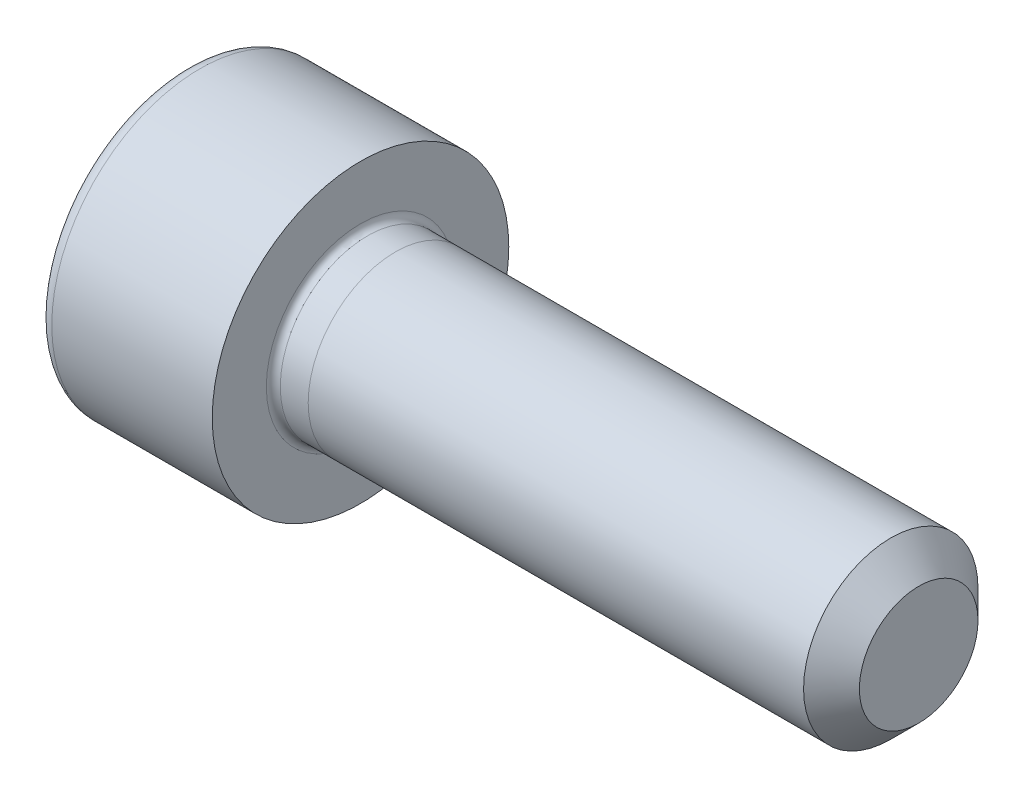
ISO-10303-21;
HEADER;
FILE_DESCRIPTION(('STEP AP214'),'2;1');
FILE_NAME('part.step','',(''),(''),'','','');
FILE_SCHEMA(('AUTOMOTIVE_DESIGN { 1 0 10303 214 1 1 1 1 }'));
ENDSEC;
DATA;
#1=APPLICATION_CONTEXT('core data for automotive mechanical design processes');
#2=APPLICATION_PROTOCOL_DEFINITION('international standard','automotive_design',2000,#1);
#3=PRODUCT_CONTEXT('',#1,'mechanical');
#4=PRODUCT('Part','Part','',(#3));
#5=PRODUCT_RELATED_PRODUCT_CATEGORY('part','',(#4));
#6=PRODUCT_DEFINITION_FORMATION('','',#4);
#7=PRODUCT_DEFINITION_CONTEXT('part definition',#1,'design');
#8=PRODUCT_DEFINITION('design','',#6,#7);
#9=PRODUCT_DEFINITION_SHAPE('','',#8);
#10=(LENGTH_UNIT() NAMED_UNIT(*) SI_UNIT(.MILLI.,.METRE.));
#11=(NAMED_UNIT(*) PLANE_ANGLE_UNIT() SI_UNIT($,.RADIAN.));
#12=(NAMED_UNIT(*) SI_UNIT($,.STERADIAN.) SOLID_ANGLE_UNIT());
#13=UNCERTAINTY_MEASURE_WITH_UNIT(LENGTH_MEASURE(1.E-05),#10,'distance_accuracy_value','');
#14=(GEOMETRIC_REPRESENTATION_CONTEXT(3) GLOBAL_UNCERTAINTY_ASSIGNED_CONTEXT((#13)) GLOBAL_UNIT_ASSIGNED_CONTEXT((#10,
#11,#12)) REPRESENTATION_CONTEXT('',''));
#15=CARTESIAN_POINT('',(0.,0.,0.));
#16=DIRECTION('',(0.,0.,1.));
#17=DIRECTION('',(1.,0.,0.));
#18=AXIS2_PLACEMENT_3D('',#15,#16,#17);
#19=CARTESIAN_POINT('',(16.,0.,0.));
#20=DIRECTION('',(-1.,0.,0.));
#21=DIRECTION('',(0.,0.,1.));
#22=AXIS2_PLACEMENT_3D('',#19,#20,#21);
#23=CYLINDRICAL_SURFACE('',#22,2.5);
#24=CARTESIAN_POINT('',(0.199999999999978,0.,0.));
#25=DIRECTION('',(-1.,0.,0.));
#26=DIRECTION('',(0.,0.,1.));
#27=AXIS2_PLACEMENT_3D('',#24,#25,#26);
#28=CIRCLE('',#27,2.5);
#29=CARTESIAN_POINT('',(0.199999999999978,0.,2.5));
#30=VERTEX_POINT('',#29);
#31=EDGE_CURVE('E195',#30,#30,#28,.F.);
#32=ORIENTED_EDGE('',*,*,#31,.T.);
#33=EDGE_LOOP('',(#32));
#34=FACE_BOUND('',#33,.T.);
#35=CARTESIAN_POINT('',(1.,0.,0.));
#36=DIRECTION('',(1.,0.,0.));
#37=DIRECTION('',(0.,1.,0.));
#38=AXIS2_PLACEMENT_3D('',#35,#36,#37);
#39=CIRCLE('',#38,2.5);
#40=CARTESIAN_POINT('',(1.,2.49999999999997,0.));
#41=VERTEX_POINT('',#40);
#42=EDGE_CURVE('E11',#41,#41,#39,.T.);
#43=ORIENTED_EDGE('',*,*,#42,.F.);
#44=EDGE_LOOP('',(#43));
#45=FACE_BOUND('',#44,.T.);
#46=ADVANCED_FACE('F44',(#34,#45),#23,.T.);
#47=ORIENTED_EDGE('',*,*,#42,.T.);
#48=EDGE_LOOP('',(#47));
#49=FACE_BOUND('',#48,.T.);
#50=CARTESIAN_POINT('',(15.2,0.,0.));
#51=DIRECTION('',(1.,0.,0.));
#52=DIRECTION('',(0.,0.,-1.));
#53=AXIS2_PLACEMENT_3D('',#50,#51,#52);
#54=CIRCLE('',#53,2.5);
#55=CARTESIAN_POINT('',(15.2,0.,-2.49999999999996));
#56=VERTEX_POINT('',#55);
#57=EDGE_CURVE('E179',#56,#56,#54,.F.);
#58=ORIENTED_EDGE('',*,*,#57,.T.);
#59=EDGE_LOOP('',(#58));
#60=FACE_BOUND('',#59,.T.);
#61=ADVANCED_FACE('F296',(#49,#60),#23,.T.);
#62=CARTESIAN_POINT('',(16.,0.,0.));
#63=DIRECTION('',(1.,0.,0.));
#64=DIRECTION('',(0.,0.,-1.));
#65=AXIS2_PLACEMENT_3D('',#62,#63,#64);
#66=PLANE('',#65);
#67=CARTESIAN_POINT('',(16.,0.,0.));
#68=DIRECTION('',(1.,0.,0.));
#69=DIRECTION('',(0.,0.,-1.));
#70=AXIS2_PLACEMENT_3D('',#67,#68,#69);
#71=CIRCLE('',#70,1.7);
#72=CARTESIAN_POINT('',(16.,0.,-1.7));
#73=VERTEX_POINT('',#72);
#74=EDGE_CURVE('E175',#73,#73,#71,.T.);
#75=ORIENTED_EDGE('',*,*,#74,.T.);
#76=EDGE_LOOP('',(#75));
#77=FACE_BOUND('',#76,.T.);
#78=ADVANCED_FACE('F302',(#77),#66,.T.);
#79=CARTESIAN_POINT('',(0.,0.,0.));
#80=DIRECTION('',(-1.,0.,0.));
#81=DIRECTION('',(0.,0.,1.));
#82=AXIS2_PLACEMENT_3D('',#79,#80,#81);
#83=PLANE('',#82);
#84=CARTESIAN_POINT('',(0.,0.,0.));
#85=DIRECTION('',(-1.,0.,0.));
#86=DIRECTION('',(0.,0.,1.));
#87=AXIS2_PLACEMENT_3D('',#84,#85,#86);
#88=CIRCLE('',#87,2.7);
#89=CARTESIAN_POINT('',(0.,0.,2.7));
#90=VERTEX_POINT('',#89);
#91=EDGE_CURVE('E191',#90,#90,#88,.T.);
#92=ORIENTED_EDGE('',*,*,#91,.T.);
#93=EDGE_LOOP('',(#92));
#94=FACE_BOUND('',#93,.T.);
#95=CARTESIAN_POINT('',(0.,0.,0.));
#96=DIRECTION('',(-1.,0.,0.));
#97=DIRECTION('',(0.,0.,1.));
#98=AXIS2_PLACEMENT_3D('',#95,#96,#97);
#99=CIRCLE('',#98,4.25);
#100=CARTESIAN_POINT('',(0.,0.,4.25));
#101=VERTEX_POINT('',#100);
#102=EDGE_CURVE('E171',#101,#101,#99,.T.);
#103=ORIENTED_EDGE('',*,*,#102,.F.);
#104=EDGE_LOOP('',(#103));
#105=FACE_BOUND('',#104,.T.);
#106=ADVANCED_FACE('F328',(#94,#105),#83,.F.);
#107=CARTESIAN_POINT('',(-5.,0.,0.));
#108=DIRECTION('',(1.,0.,0.));
#109=DIRECTION('',(0.,0.,-1.));
#110=AXIS2_PLACEMENT_3D('',#107,#108,#109);
#111=CYLINDRICAL_SURFACE('',#110,4.25);
#112=CARTESIAN_POINT('',(-4.59999999999999,0.,0.));
#113=DIRECTION('',(-1.,0.,0.));
#114=DIRECTION('',(0.,0.,1.));
#115=AXIS2_PLACEMENT_3D('',#112,#113,#114);
#116=CIRCLE('',#115,4.25);
#117=CARTESIAN_POINT('',(-4.59999999999999,0.,4.25000000000001));
#118=VERTEX_POINT('',#117);
#119=EDGE_CURVE('E187',#118,#118,#116,.F.);
#120=ORIENTED_EDGE('',*,*,#119,.T.);
#121=EDGE_LOOP('',(#120));
#122=FACE_BOUND('',#121,.T.);
#123=ORIENTED_EDGE('',*,*,#102,.T.);
#124=EDGE_LOOP('',(#123));
#125=FACE_BOUND('',#124,.T.);
#126=ADVANCED_FACE('F331',(#122,#125),#111,.T.);
#127=CARTESIAN_POINT('',(-5.,0.,0.));
#128=DIRECTION('',(-1.,0.,0.));
#129=DIRECTION('',(0.,0.,1.));
#130=AXIS2_PLACEMENT_3D('',#127,#128,#129);
#131=PLANE('',#130);
#132=CARTESIAN_POINT('',(-5.,0.,0.));
#133=DIRECTION('',(-1.,0.,0.));
#134=DIRECTION('',(0.,0.,1.));
#135=AXIS2_PLACEMENT_3D('',#132,#133,#134);
#136=CIRCLE('',#135,2.4);
#137=CARTESIAN_POINT('',(-5.,0.,2.40000000000001));
#138=VERTEX_POINT('',#137);
#139=EDGE_CURVE('E199',#138,#138,#136,.F.);
#140=ORIENTED_EDGE('',*,*,#139,.T.);
#141=EDGE_LOOP('',(#140));
#142=FACE_BOUND('',#141,.T.);
#143=CARTESIAN_POINT('',(-5.,0.,0.));
#144=DIRECTION('',(-1.,0.,0.));
#145=DIRECTION('',(0.,0.,1.));
#146=AXIS2_PLACEMENT_3D('',#143,#144,#145);
#147=CIRCLE('',#146,3.85);
#148=CARTESIAN_POINT('',(-5.00000000000001,0.,3.85000000000001));
#149=VERTEX_POINT('',#148);
#150=EDGE_CURVE('E183',#149,#149,#147,.T.);
#151=ORIENTED_EDGE('',*,*,#150,.T.);
#152=EDGE_LOOP('',(#151));
#153=FACE_BOUND('',#152,.T.);
#154=ADVANCED_FACE('F312',(#142,#153),#131,.T.);
#155=CARTESIAN_POINT('',(16.,0.,0.));
#156=DIRECTION('',(-1.,0.,0.));
#157=DIRECTION('',(0.,0.,1.));
#158=AXIS2_PLACEMENT_3D('',#155,#156,#157);
#159=CONICAL_SURFACE('',#158,1.7,0.785398163397446);
#160=ORIENTED_EDGE('',*,*,#57,.F.);
#161=EDGE_LOOP('',(#160));
#162=FACE_BOUND('',#161,.T.);
#163=ORIENTED_EDGE('',*,*,#74,.F.);
#164=EDGE_LOOP('',(#163));
#165=FACE_BOUND('',#164,.T.);
#166=ADVANCED_FACE('F308',(#162,#165),#159,.T.);
#167=CARTESIAN_POINT('',(-4.59999999999999,0.,0.));
#168=DIRECTION('',(-1.,0.,0.));
#169=DIRECTION('',(0.,0.,1.));
#170=AXIS2_PLACEMENT_3D('',#167,#168,#169);
#171=TOROIDAL_SURFACE('',#170,3.85,0.4);
#172=ORIENTED_EDGE('',*,*,#119,.F.);
#173=EDGE_LOOP('',(#172));
#174=FACE_BOUND('',#173,.T.);
#175=ORIENTED_EDGE('',*,*,#150,.F.);
#176=EDGE_LOOP('',(#175));
#177=FACE_BOUND('',#176,.T.);
#178=ADVANCED_FACE('F311',(#174,#177),#171,.T.);
#179=CARTESIAN_POINT('',(0.199999999999978,0.,0.));
#180=DIRECTION('',(-1.,0.,0.));
#181=DIRECTION('',(0.,0.,1.));
#182=AXIS2_PLACEMENT_3D('',#179,#180,#181);
#183=TOROIDAL_SURFACE('',#182,2.7,0.2);
#184=ORIENTED_EDGE('',*,*,#31,.F.);
#185=EDGE_LOOP('',(#184));
#186=FACE_BOUND('',#185,.T.);
#187=ORIENTED_EDGE('',*,*,#91,.F.);
#188=EDGE_LOOP('',(#187));
#189=FACE_BOUND('',#188,.T.);
#190=ADVANCED_FACE('F315',(#186,#189),#183,.F.);
#191=CARTESIAN_POINT('',(-4.76905989232412,0.,0.));
#192=DIRECTION('',(-1.,0.,0.));
#193=DIRECTION('',(0.,0.,1.));
#194=AXIS2_PLACEMENT_3D('',#191,#192,#193);
#195=CONICAL_SURFACE('',#194,2.,1.0471975511966);
#196=CARTESIAN_POINT('',(-4.94775935894465,0.000200000000005751,-2.3095165468123));
#197=CARTESIAN_POINT('',(-4.91844942842481,-0.087691262900059,-2.25877250251755));
#198=CARTESIAN_POINT('',(-4.8917927443046,-0.176341194473595,-2.20759044065994));
#199=CARTESIAN_POINT('',(-4.84526238334485,-0.355176246997811,-2.10433997494455));
#200=CARTESIAN_POINT('',(-4.82540516870691,-0.445364546505047,-2.05226973594629));
#201=CARTESIAN_POINT('',(-4.79449335634738,-0.624623385763312,-1.9487745968459));
#202=CARTESIAN_POINT('',(-4.78323304392266,-0.713666338226305,-1.89736562427194));
#203=CARTESIAN_POINT('',(-4.76978855491878,-0.892171397785061,-1.79430568008402));
#204=CARTESIAN_POINT('',(-4.76759324727761,-0.981632855703997,-1.74265508327248));
#205=CARTESIAN_POINT('',(-4.77215088165479,-1.14880835354883,-1.64613626458984));
#206=CARTESIAN_POINT('',(-4.77778476701115,-1.2265473702658,-1.60125362236172));
#207=CARTESIAN_POINT('',(-4.79564378758496,-1.38151891453613,-1.51178075956048));
#208=CARTESIAN_POINT('',(-4.80787502834758,-1.4587509057412,-1.4671908486482));
#209=CARTESIAN_POINT('',(-4.83845332919175,-1.6140421864822,-1.37753338590959));
#210=CARTESIAN_POINT('',(-4.85693005938985,-1.69208181310737,-1.33247718647008));
#211=CARTESIAN_POINT('',(-4.89886541053699,-1.84699686569212,-1.24303693915875));
#212=CARTESIAN_POINT('',(-4.92231417281645,-1.9238742776231,-1.19865174468579));
#213=CARTESIAN_POINT('',(-4.94775935894465,-2.00019999999998,-1.15458506832541));
#214=B_SPLINE_CURVE_WITH_KNOTS('',3,(#196,#197,#198,#199,#200,#201,#202,#203,#204,#205,#206,
#207,#208,#209,#210,#211,#212,#213),.UNSPECIFIED.,.F.,.F.,(4,2,2,2,2,2,2,2,4),(0.,
0.317031824695614,0.634825876346569,0.944753967652642,1.25430138000372,1.52387047293094,
1.79368946861027,2.06949491027632,2.3447585082147),.UNSPECIFIED.);
#215=CARTESIAN_POINT('',(-4.94769268727824,0.,-2.30940107675848));
#216=VERTEX_POINT('',#215);
#217=CARTESIAN_POINT('',(-4.94769268727824,-1.99999999999995,-1.15470053837927));
#218=VERTEX_POINT('',#217);
#219=EDGE_CURVE('E254',#216,#218,#214,.T.);
#220=ORIENTED_EDGE('',*,*,#219,.F.);
#221=CARTESIAN_POINT('',(-4.94775935894465,2.00020000000004,-1.15458506832539));
#222=CARTESIAN_POINT('',(-4.91844942842481,1.91230873709997,-1.20532911262015));
#223=CARTESIAN_POINT('',(-4.89179274430459,1.82365880552644,-1.25651117447777));
#224=CARTESIAN_POINT('',(-4.84526238334484,1.64482375300222,-1.35976164019317));
#225=CARTESIAN_POINT('',(-4.8254051687069,1.55463545349498,-1.41183187919143));
#226=CARTESIAN_POINT('',(-4.79449335634737,1.37537661423671,-1.51532701829182));
#227=CARTESIAN_POINT('',(-4.78323304392264,1.28633366177371,-1.56673599086577));
#228=CARTESIAN_POINT('',(-4.76978855491877,1.10782860221496,-1.66979593505372));
#229=CARTESIAN_POINT('',(-4.76759324727761,1.01836714429604,-1.7214465318653));
#230=CARTESIAN_POINT('',(-4.77215088165479,0.851191646451192,-1.81796535054793));
#231=CARTESIAN_POINT('',(-4.77778476701114,0.773452629734206,-1.86284799277603));
#232=CARTESIAN_POINT('',(-4.79564378758495,0.618481085463856,-1.95232085557725));
#233=CARTESIAN_POINT('',(-4.80787502834756,0.541249094258791,-1.99691076648954));
#234=CARTESIAN_POINT('',(-4.83845332919174,0.385957813517788,-2.08656822922816));
#235=CARTESIAN_POINT('',(-4.85693005938984,0.307918186892609,-2.13162442866766));
#236=CARTESIAN_POINT('',(-4.89886541053699,0.153003134307854,-2.221064675979));
#237=CARTESIAN_POINT('',(-4.92231417281645,0.0761257223768703,-2.26544987045196));
#238=CARTESIAN_POINT('',(-4.94775935894465,-0.000200000000005751,-2.30951654681234));
#239=B_SPLINE_CURVE_WITH_KNOTS('',3,(#221,#222,#223,#224,#225,#226,#227,#228,#229,#230,#231,
#232,#233,#234,#235,#236,#237,#238),.UNSPECIFIED.,.F.,.F.,(4,2,2,2,2,2,2,2,4),(0.,
0.317031824695627,0.634825876346591,0.944753967652676,1.25430138000377,1.523870472931,
1.79368946861034,2.0694949102764,2.34475850821479),.UNSPECIFIED.);
#240=CARTESIAN_POINT('',(-4.94769268727824,2.00000000000003,-1.15470053837924));
#241=VERTEX_POINT('',#240);
#242=EDGE_CURVE('E231',#241,#216,#239,.T.);
#243=ORIENTED_EDGE('',*,*,#242,.F.);
#244=CARTESIAN_POINT('',(-5.7296245130441,2.,-3.06969706647028));
#245=CARTESIAN_POINT('',(-5.68750761154934,2.00000000000002,-2.98260702760984));
#246=CARTESIAN_POINT('',(-5.64580390848698,2.00000000000003,-2.8953135951495));
#247=CARTESIAN_POINT('',(-5.56345596036491,2.00000000000003,-2.72021165343405));
#248=CARTESIAN_POINT('',(-5.52281188889613,2.00000000000003,-2.63240306263539));
#249=CARTESIAN_POINT('',(-5.44260488331756,2.00000000000003,-2.45569454632304));
#250=CARTESIAN_POINT('',(-5.40304932826782,2.00000000000003,-2.36679125959118));
#251=CARTESIAN_POINT('',(-5.32560029447873,2.00000000000003,-2.18826628410369));
#252=CARTESIAN_POINT('',(-5.28770673495887,2.00000000000003,-2.09864463051492));
#253=CARTESIAN_POINT('',(-5.21288954587424,2.00000000000003,-1.91577344840972));
#254=CARTESIAN_POINT('',(-5.1760313704263,2.00000000000003,-1.82249699059148));
#255=CARTESIAN_POINT('',(-5.10518283158684,2.00000000000003,-1.63484103533505));
#256=CARTESIAN_POINT('',(-5.07119279447057,2.00000000000003,-1.54046141378923));
#257=CARTESIAN_POINT('',(-5.00699637104713,2.00000000000003,-1.35063624877524));
#258=CARTESIAN_POINT('',(-4.97678203952794,2.00000000000002,-1.25519342016053));
#259=CARTESIAN_POINT('',(-4.92112753019565,2.00000000000004,-1.06293935737286));
#260=CARTESIAN_POINT('',(-4.89568581427327,2.00000000000006,-0.966128574914693));
#261=CARTESIAN_POINT('',(-4.85095209042622,2.00000000000006,-0.771614672106002));
#262=CARTESIAN_POINT('',(-4.83162795344868,2.00000000000004,-0.673919082405816));
#263=CARTESIAN_POINT('',(-4.80024257522784,2.00000000000002,-0.477348057700167));
#264=CARTESIAN_POINT('',(-4.78818070998057,2.00000000000003,-0.378472724807782));
#265=CARTESIAN_POINT('',(-4.77244384927367,2.00000000000003,-0.181309994953027));
#266=CARTESIAN_POINT('',(-4.76866358667925,2.00000000000004,-0.0830312460429689));
#267=CARTESIAN_POINT('',(-4.76952313075927,2.00000000000002,0.113485509919459));
#268=CARTESIAN_POINT('',(-4.77416316778038,2.00000000000001,0.211723515783724));
#269=CARTESIAN_POINT('',(-4.79516424597696,2.,0.449358015625662));
#270=CARTESIAN_POINT('',(-4.81568943998104,2.00000000000002,0.588388308666211));
#271=CARTESIAN_POINT('',(-4.86992569623103,2.00000000000004,0.863858384666757));
#272=CARTESIAN_POINT('',(-4.90365012014143,2.00000000000003,1.00029539521148));
#273=CARTESIAN_POINT('',(-4.98146210262977,2.00000000000003,1.27331112375956));
#274=CARTESIAN_POINT('',(-5.02575865262952,2.00000000000003,1.4098286752554));
#275=CARTESIAN_POINT('',(-5.12124259085567,2.00000000000003,1.68033618831136));
#276=CARTESIAN_POINT('',(-5.17242790952426,2.00000000000003,1.81432689526777));
#277=CARTESIAN_POINT('',(-5.29449531516151,2.00000000000003,2.11741952061406));
#278=CARTESIAN_POINT('',(-5.36689239539111,2.00000000000003,2.2859050119817));
#279=CARTESIAN_POINT('',(-5.51669751243031,2.00000000000003,2.62064677617024));
#280=CARTESIAN_POINT('',(-5.59410667028059,2.00000000000003,2.78690254016499));
#281=CARTESIAN_POINT('',(-5.75234923578388,2.00000000000003,3.11794960660755));
#282=CARTESIAN_POINT('',(-5.83318562186147,2.00000000000003,3.28273947819277));
#283=CARTESIAN_POINT('',(-5.99719159006481,2.00000000000003,3.61115513686861));
#284=CARTESIAN_POINT('',(-6.08036124351998,2.00000000000003,3.77478088817924));
#285=CARTESIAN_POINT('',(-6.24182997829835,2.00000000000003,4.08845140851658));
#286=CARTESIAN_POINT('',(-6.32000359320683,2.00000000000003,4.23856092803466));
#287=CARTESIAN_POINT('',(-6.47743207719216,2.00000000000003,4.53821671672567));
#288=CARTESIAN_POINT('',(-6.55668697774608,2.00000000000003,4.68776296933905));
#289=CARTESIAN_POINT('',(-6.71585227409501,2.00000000000003,4.98608322935768));
#290=CARTESIAN_POINT('',(-6.79576084485697,2.00000000000003,5.1348582118245));
#291=CARTESIAN_POINT('',(-6.95623484615692,2.00000000000003,5.43204425779148));
#292=CARTESIAN_POINT('',(-7.03680024437928,2.00000000000002,5.58045533873371));
#293=CARTESIAN_POINT('',(-7.11761287236257,2.,5.72873071831081));
#294=B_SPLINE_CURVE_WITH_KNOTS('',3,(#244,#245,#246,#247,#248,#249,#250,#251,#252,#253,#254,
#255,#256,#257,#258,#259,#260,#261,#262,#263,#264,#265,#266,#267,#268,#269,#270,#271,#272,#273,
#274,#275,#276,#277,#278,#279,#280,#281,#282,#283,#284,#285,#286,#287,#288,#289,#290,#291,#292,
#293),.UNSPECIFIED.,.F.,.F.,(4,2,2,2,2,2,2,2,2,2,2,2,2,2,2,2,2,2,2,2,2,2,2,2,4),(0.,
0.290221855965848,0.580490961635773,0.872395030380335,1.16428489550747,1.46513250000125,
1.76601428247192,2.06625185869287,2.36639250807089,2.6649296354442,2.9634411076283,
3.25813564536259,3.55283824491537,3.97358015663301,4.39474909430442,4.82505701428421,
5.25523594641711,5.8052445091099,6.35537651886982,6.90599683350137,7.45663399931509,
7.96436452021769,8.4721098532279,8.97873847526988,9.48534232003233),.UNSPECIFIED.);
#295=CARTESIAN_POINT('',(-4.94769268727824,2.,1.15470053837927));
#296=VERTEX_POINT('',#295);
#297=EDGE_CURVE('E209',#296,#241,#294,.F.);
#298=ORIENTED_EDGE('',*,*,#297,.F.);
#299=CARTESIAN_POINT('',(-4.94775935894465,-0.000200000000005751,2.30951654681238));
#300=CARTESIAN_POINT('',(-4.91844942842481,0.0876912629000481,2.2587725025176));
#301=CARTESIAN_POINT('',(-4.89179274430459,0.176341194473582,2.20759044065998));
#302=CARTESIAN_POINT('',(-4.84526238334484,0.355176246997803,2.10433997494458));
#303=CARTESIAN_POINT('',(-4.8254051687069,0.445364546505044,2.05226973594632));
#304=CARTESIAN_POINT('',(-4.79449335634737,0.624623385763318,1.94877459684593));
#305=CARTESIAN_POINT('',(-4.78323304392264,0.713666338226315,1.89736562427196));
#306=CARTESIAN_POINT('',(-4.76978855491877,0.892171397785079,1.79430568008404));
#307=CARTESIAN_POINT('',(-4.76759324727761,0.98163285570402,1.74265508327249));
#308=CARTESIAN_POINT('',(-4.77215088165479,1.14880835354886,1.64613626458985));
#309=CARTESIAN_POINT('',(-4.77778476701114,1.22654737026583,1.60125362236173));
#310=CARTESIAN_POINT('',(-4.79564378758494,1.38151891453616,1.51178075956049));
#311=CARTESIAN_POINT('',(-4.80787502834756,1.45875090574123,1.46719084864821));
#312=CARTESIAN_POINT('',(-4.83845332919173,1.61404218648223,1.37753338590959));
#313=CARTESIAN_POINT('',(-4.85693005938983,1.69208181310741,1.33247718647009));
#314=CARTESIAN_POINT('',(-4.89886541053698,1.84699686569216,1.24303693915876));
#315=CARTESIAN_POINT('',(-4.92231417281644,1.92387427762315,1.19865174468581));
#316=CARTESIAN_POINT('',(-4.94775935894465,2.00020000000004,1.15458506832546));
#317=B_SPLINE_CURVE_WITH_KNOTS('',3,(#299,#300,#301,#302,#303,#304,#305,#306,#307,#308,#309,
#310,#311,#312,#313,#314,#315,#316),.UNSPECIFIED.,.F.,.F.,(4,2,2,2,2,2,2,2,4),(0.,
0.317031824695631,0.6348258763466,0.944753967652689,1.25430138000378,1.52387047293101,
1.79368946861034,2.06949491027639,2.34475850821477),.UNSPECIFIED.);
#318=CARTESIAN_POINT('',(-4.94769268727824,0.,2.30940107675853));
#319=VERTEX_POINT('',#318);
#320=EDGE_CURVE('E203',#319,#296,#317,.T.);
#321=ORIENTED_EDGE('',*,*,#320,.F.);
#322=CARTESIAN_POINT('',(-4.94775935894465,-2.00019999999998,1.15458506832546));
#323=CARTESIAN_POINT('',(-4.91844942842481,-1.91230873709991,1.20532911262019));
#324=CARTESIAN_POINT('',(-4.89179274430459,-1.82365880552637,1.25651117447781));
#325=CARTESIAN_POINT('',(-4.84526238334484,-1.64482375300216,1.3597616401932));
#326=CARTESIAN_POINT('',(-4.8254051687069,-1.55463545349493,1.41183187919146));
#327=CARTESIAN_POINT('',(-4.79449335634737,-1.37537661423666,1.51532701829183));
#328=CARTESIAN_POINT('',(-4.78323304392264,-1.28633366177365,1.56673599086577));
#329=CARTESIAN_POINT('',(-4.76978855491877,-1.10782860221493,1.66979593505375));
#330=CARTESIAN_POINT('',(-4.76759324727761,-1.01836714429604,1.72144653186538));
#331=CARTESIAN_POINT('',(-4.77215088165479,-0.85119164645119,1.817965350548));
#332=CARTESIAN_POINT('',(-4.77778476701114,-0.773452629734182,1.86284799277605));
#333=CARTESIAN_POINT('',(-4.79564378758494,-0.618481085463816,1.95232085557724));
#334=CARTESIAN_POINT('',(-4.80787502834756,-0.541249094258758,1.99691076648955));
#335=CARTESIAN_POINT('',(-4.83845332919173,-0.385957813517759,2.08656822922817));
#336=CARTESIAN_POINT('',(-4.85693005938983,-0.307918186892577,2.13162442866767));
#337=CARTESIAN_POINT('',(-4.89886541053698,-0.153003134307826,2.22106467597901));
#338=CARTESIAN_POINT('',(-4.92231417281644,-0.0761257223768489,2.26544987045198));
#339=CARTESIAN_POINT('',(-4.94775935894465,0.000200000000005751,2.3095165468124));
#340=B_SPLINE_CURVE_WITH_KNOTS('',3,(#322,#323,#324,#325,#326,#327,#328,#329,#330,#331,#332,
#333,#334,#335,#336,#337,#338,#339),.UNSPECIFIED.,.F.,.F.,(4,2,2,2,2,2,2,2,4),(0.,
0.317031824695616,0.634825876346568,0.944753967652641,1.25430138000372,1.52387047293095,
1.79368946861029,2.06949491027635,2.34475850821473),.UNSPECIFIED.);
#341=CARTESIAN_POINT('',(-4.94769268727824,-1.99999999999997,1.15470053837924));
#342=VERTEX_POINT('',#341);
#343=EDGE_CURVE('E126',#342,#319,#340,.T.);
#344=ORIENTED_EDGE('',*,*,#343,.F.);
#345=CARTESIAN_POINT('',(-5.72962451304404,-2.,-3.0696970664703));
#346=CARTESIAN_POINT('',(-5.68750761154931,-1.99999999999997,-2.98260702760984));
#347=CARTESIAN_POINT('',(-5.64580390848696,-1.99999999999995,-2.8953135951495));
#348=CARTESIAN_POINT('',(-5.5634559603649,-1.99999999999994,-2.72021165343405));
#349=CARTESIAN_POINT('',(-5.52281188889612,-1.99999999999994,-2.63240306263539));
#350=CARTESIAN_POINT('',(-5.44260488331754,-1.99999999999995,-2.45569454632304));
#351=CARTESIAN_POINT('',(-5.4030493282678,-1.99999999999995,-2.36679125959118));
#352=CARTESIAN_POINT('',(-5.32560029447872,-1.99999999999994,-2.18826628410369));
#353=CARTESIAN_POINT('',(-5.28770673495886,-1.99999999999994,-2.09864463051492));
#354=CARTESIAN_POINT('',(-5.21288954587423,-1.99999999999995,-1.91577344840973));
#355=CARTESIAN_POINT('',(-5.17603137042628,-1.99999999999995,-1.82249699059148));
#356=CARTESIAN_POINT('',(-5.10518283158683,-1.99999999999994,-1.63484103533506));
#357=CARTESIAN_POINT('',(-5.07119279447057,-1.99999999999994,-1.54046141378924));
#358=CARTESIAN_POINT('',(-5.00699637104712,-1.99999999999995,-1.35063624877525));
#359=CARTESIAN_POINT('',(-4.97678203952792,-1.99999999999995,-1.25519342016054));
#360=CARTESIAN_POINT('',(-4.92112753019564,-1.99999999999994,-1.06293935737287));
#361=CARTESIAN_POINT('',(-4.89568581427327,-1.99999999999992,-0.966128574914706));
#362=CARTESIAN_POINT('',(-4.85095209042622,-1.99999999999992,-0.771614672106016));
#363=CARTESIAN_POINT('',(-4.83162795344866,-1.99999999999994,-0.673919082405831));
#364=CARTESIAN_POINT('',(-4.80024257522783,-1.99999999999995,-0.477348057700183));
#365=CARTESIAN_POINT('',(-4.78818070998055,-1.99999999999995,-0.378472724807797));
#366=CARTESIAN_POINT('',(-4.77244384927365,-1.99999999999994,-0.181309994953041));
#367=CARTESIAN_POINT('',(-4.76866358667923,-1.99999999999993,-0.0830312460429837));
#368=CARTESIAN_POINT('',(-4.76952313075925,-1.99999999999996,0.113485509919444));
#369=CARTESIAN_POINT('',(-4.77416316778037,-1.99999999999999,0.211723515783709));
#370=CARTESIAN_POINT('',(-4.79516424597696,-2.00000000000001,0.449358015625649));
#371=CARTESIAN_POINT('',(-4.81568943998103,-1.99999999999996,0.588388308666201));
#372=CARTESIAN_POINT('',(-4.869925696231,-1.99999999999993,0.863858384666749));
#373=CARTESIAN_POINT('',(-4.90365012014141,-1.99999999999994,1.00029539521147));
#374=CARTESIAN_POINT('',(-4.98146210262975,-1.99999999999995,1.27331112375955));
#375=CARTESIAN_POINT('',(-5.0257586526295,-1.99999999999994,1.40982867525539));
#376=CARTESIAN_POINT('',(-5.12124259085565,-1.99999999999995,1.68033618831135));
#377=CARTESIAN_POINT('',(-5.17242790952425,-1.99999999999997,1.81432689526776));
#378=CARTESIAN_POINT('',(-5.29449531516151,-1.99999999999998,2.11741952061405));
#379=CARTESIAN_POINT('',(-5.3668923953911,-1.99999999999995,2.28590501198169));
#380=CARTESIAN_POINT('',(-5.51669751243029,-1.99999999999994,2.62064677617024));
#381=CARTESIAN_POINT('',(-5.59410667028058,-1.99999999999994,2.78690254016499));
#382=CARTESIAN_POINT('',(-5.75234923578387,-1.99999999999995,3.11794960660756));
#383=CARTESIAN_POINT('',(-5.83318562186146,-1.99999999999994,3.28273947819278));
#384=CARTESIAN_POINT('',(-5.9971915900648,-1.99999999999994,3.61115513686861));
#385=CARTESIAN_POINT('',(-6.08036124351997,-1.99999999999994,3.77478088817925));
#386=CARTESIAN_POINT('',(-6.24182997829834,-1.99999999999994,4.08845140851659));
#387=CARTESIAN_POINT('',(-6.32000359320683,-1.99999999999994,4.23856092803467));
#388=CARTESIAN_POINT('',(-6.47743207719215,-1.99999999999994,4.53821671672568));
#389=CARTESIAN_POINT('',(-6.55668697774608,-1.99999999999995,4.68776296933906));
#390=CARTESIAN_POINT('',(-6.71585227409501,-1.99999999999994,4.98608322935769));
#391=CARTESIAN_POINT('',(-6.79576084485697,-1.99999999999993,5.1348582118245));
#392=CARTESIAN_POINT('',(-6.95623484615692,-1.99999999999995,5.4320442577915));
#393=CARTESIAN_POINT('',(-7.03680024437928,-1.99999999999998,5.58045533873372));
#394=CARTESIAN_POINT('',(-7.11761287236257,-2.00000000000006,5.72873071831083));
#395=B_SPLINE_CURVE_WITH_KNOTS('',3,(#345,#346,#347,#348,#349,#350,#351,#352,#353,#354,#355,
#356,#357,#358,#359,#360,#361,#362,#363,#364,#365,#366,#367,#368,#369,#370,#371,#372,#373,#374,
#375,#376,#377,#378,#379,#380,#381,#382,#383,#384,#385,#386,#387,#388,#389,#390,#391,#392,#393,
#394),.UNSPECIFIED.,.F.,.F.,(4,2,2,2,2,2,2,2,2,2,2,2,2,2,2,2,2,2,2,2,2,2,2,2,4),(0.,
0.290221855965847,0.58049096163577,0.872395030380328,1.16428489550746,1.46513250000124,
1.7660142824719,2.06625185869285,2.36639250807086,2.66492963544418,2.96344110762828,
3.25813564536257,3.55283824491535,3.97358015663299,4.3947490943044,4.82505701428419,
5.2552359464171,5.8052445091099,6.35537651886982,6.90599683350138,7.4566339993151,
7.96436452021769,8.47210985322791,8.97873847526989,9.48534232003235),.UNSPECIFIED.);
#396=EDGE_CURVE('E237',#218,#342,#395,.T.);
#397=ORIENTED_EDGE('',*,*,#396,.F.);
#398=EDGE_LOOP('',(#220,#243,#298,#321,#344,#397));
#399=FACE_BOUND('',#398,.T.);
#400=ORIENTED_EDGE('',*,*,#139,.F.);
#401=EDGE_LOOP('',(#400));
#402=FACE_BOUND('',#401,.T.);
#403=ADVANCED_FACE('F46',(#399,#402),#195,.F.);
#404=CARTESIAN_POINT('',(-2.19999999999998,0.,2.30940107675852));
#405=DIRECTION('',(-1.,0.,0.));
#406=DIRECTION('',(0.,0.,1.));
#407=AXIS2_PLACEMENT_3D('',#404,#405,#406);
#408=PLANE('',#407);
#409=CARTESIAN_POINT('',(-2.19999999999998,0.,0.));
#410=DIRECTION('',(-1.,0.,0.));
#411=DIRECTION('',(0.,0.,1.));
#412=AXIS2_PLACEMENT_3D('',#409,#410,#411);
#413=CIRCLE('',#412,2.);
#414=CARTESIAN_POINT('',(-2.19999999999998,-1.,1.73205080756891));
#415=VERTEX_POINT('',#414);
#416=CARTESIAN_POINT('',(-2.19999999999998,-2.,0.));
#417=VERTEX_POINT('',#416);
#418=EDGE_CURVE('E54',#415,#417,#413,.F.);
#419=ORIENTED_EDGE('',*,*,#418,.T.);
#420=DIRECTION('',(0.,0.,1.));
#421=VECTOR('',#420,1.);
#422=CARTESIAN_POINT('',(-2.19999999999998,-1.99999999999995,-1.15470053837924));
#423=LINE('',#422,#421);
#424=CARTESIAN_POINT('',(-2.19999999999998,-1.99999999999997,1.15470053837925));
#425=VERTEX_POINT('',#424);
#426=EDGE_CURVE('E149',#417,#425,#423,.T.);
#427=ORIENTED_EDGE('',*,*,#426,.T.);
#428=DIRECTION('',(0.,0.866025403784438,0.5));
#429=VECTOR('',#428,1.);
#430=CARTESIAN_POINT('',(-2.19999999999998,-1.99999999999997,1.15470053837925));
#431=LINE('',#430,#429);
#432=EDGE_CURVE('E119',#425,#415,#431,.T.);
#433=ORIENTED_EDGE('',*,*,#432,.T.);
#434=EDGE_LOOP('',(#419,#427,#433));
#435=FACE_BOUND('',#434,.T.);
#436=ADVANCED_FACE('F322',(#435),#408,.T.);
#437=CARTESIAN_POINT('',(-2.19999999999998,-1.,-1.7320508075689));
#438=VERTEX_POINT('',#437);
#439=EDGE_CURVE('E263',#417,#438,#413,.F.);
#440=ORIENTED_EDGE('',*,*,#439,.T.);
#441=DIRECTION('',(0.,-0.866025403784439,0.5));
#442=VECTOR('',#441,1.);
#443=CARTESIAN_POINT('',(-2.19999999999998,0.,-2.30940107675848));
#444=LINE('',#443,#442);
#445=CARTESIAN_POINT('',(-2.19999999999998,-1.99999999999995,-1.15470053837924));
#446=VERTEX_POINT('',#445);
#447=EDGE_CURVE('E145',#438,#446,#444,.T.);
#448=ORIENTED_EDGE('',*,*,#447,.T.);
#449=EDGE_CURVE('E129',#446,#417,#423,.T.);
#450=ORIENTED_EDGE('',*,*,#449,.T.);
#451=EDGE_LOOP('',(#440,#448,#450));
#452=FACE_BOUND('',#451,.T.);
#453=ADVANCED_FACE('F378',(#452),#408,.T.);
#454=CARTESIAN_POINT('',(-2.19999999999998,0.999999999999945,-1.73205080756885));
#455=VERTEX_POINT('',#454);
#456=EDGE_CURVE('E267',#438,#455,#413,.F.);
#457=ORIENTED_EDGE('',*,*,#456,.T.);
#458=DIRECTION('',(0.,-0.866025403784438,-0.5));
#459=VECTOR('',#458,1.);
#460=CARTESIAN_POINT('',(-2.19999999999998,2.00000000000003,-1.15470053837922));
#461=LINE('',#460,#459);
#462=CARTESIAN_POINT('',(-2.19999999999998,0.,-2.30940107675848));
#463=VERTEX_POINT('',#462);
#464=EDGE_CURVE('E141',#455,#463,#461,.T.);
#465=ORIENTED_EDGE('',*,*,#464,.T.);
#466=EDGE_CURVE('E146',#463,#438,#444,.T.);
#467=ORIENTED_EDGE('',*,*,#466,.T.);
#468=EDGE_LOOP('',(#457,#465,#467));
#469=FACE_BOUND('',#468,.T.);
#470=ADVANCED_FACE('F386',(#469),#408,.T.);
#471=CARTESIAN_POINT('',(-2.19999999999998,2.00000000000003,0.));
#472=VERTEX_POINT('',#471);
#473=EDGE_CURVE('E262',#455,#472,#413,.F.);
#474=ORIENTED_EDGE('',*,*,#473,.T.);
#475=DIRECTION('',(0.,0.,-1.));
#476=VECTOR('',#475,1.);
#477=CARTESIAN_POINT('',(-2.19999999999998,2.00000000000003,1.15470053837928));
#478=LINE('',#477,#476);
#479=CARTESIAN_POINT('',(-2.19999999999998,2.00000000000003,-1.15470053837922));
#480=VERTEX_POINT('',#479);
#481=EDGE_CURVE('E135',#472,#480,#478,.T.);
#482=ORIENTED_EDGE('',*,*,#481,.T.);
#483=EDGE_CURVE('E142',#480,#455,#461,.T.);
#484=ORIENTED_EDGE('',*,*,#483,.T.);
#485=EDGE_LOOP('',(#474,#482,#484));
#486=FACE_BOUND('',#485,.T.);
#487=ADVANCED_FACE('F277',(#486),#408,.T.);
#488=CARTESIAN_POINT('',(-2.19999999999998,1.,1.73205080756895));
#489=VERTEX_POINT('',#488);
#490=EDGE_CURVE('E260',#472,#489,#413,.F.);
#491=ORIENTED_EDGE('',*,*,#490,.T.);
#492=DIRECTION('',(0.,0.866025403784438,-0.5));
#493=VECTOR('',#492,1.);
#494=CARTESIAN_POINT('',(-2.19999999999998,0.,2.30940107675852));
#495=LINE('',#494,#493);
#496=CARTESIAN_POINT('',(-2.19999999999998,2.00000000000003,1.15470053837928));
#497=VERTEX_POINT('',#496);
#498=EDGE_CURVE('E133',#489,#497,#495,.T.);
#499=ORIENTED_EDGE('',*,*,#498,.T.);
#500=EDGE_CURVE('E137',#497,#472,#478,.T.);
#501=ORIENTED_EDGE('',*,*,#500,.T.);
#502=EDGE_LOOP('',(#491,#499,#501));
#503=FACE_BOUND('',#502,.T.);
#504=ADVANCED_FACE('F285',(#503),#408,.T.);
#505=EDGE_CURVE('E65',#489,#415,#413,.F.);
#506=ORIENTED_EDGE('',*,*,#505,.T.);
#507=CARTESIAN_POINT('',(-2.19999999999998,0.,2.30940107675852));
#508=VERTEX_POINT('',#507);
#509=EDGE_CURVE('E113',#415,#508,#431,.T.);
#510=ORIENTED_EDGE('',*,*,#509,.T.);
#511=EDGE_CURVE('E61',#508,#489,#495,.T.);
#512=ORIENTED_EDGE('',*,*,#511,.T.);
#513=EDGE_LOOP('',(#506,#510,#512));
#514=FACE_BOUND('',#513,.T.);
#515=ADVANCED_FACE('F115',(#514),#408,.T.);
#516=CARTESIAN_POINT('',(-2.19999999999998,-1.99999999999997,1.15470053837925));
#517=DIRECTION('',(0.,-0.5,0.866025403784439));
#518=DIRECTION('',(0.,-0.866025403784439,-0.5));
#519=AXIS2_PLACEMENT_3D('',#516,#517,#518);
#520=PLANE('',#519);
#521=ORIENTED_EDGE('',*,*,#343,.T.);
#522=DIRECTION('',(-1.,0.,0.));
#523=VECTOR('',#522,1.);
#524=CARTESIAN_POINT('',(-2.19999999999998,0.,2.30940107675852));
#525=LINE('',#524,#523);
#526=EDGE_CURVE('E123',#508,#319,#525,.T.);
#527=ORIENTED_EDGE('',*,*,#526,.F.);
#528=ORIENTED_EDGE('',*,*,#509,.F.);
#529=ORIENTED_EDGE('',*,*,#432,.F.);
#530=DIRECTION('',(-1.,0.,0.));
#531=VECTOR('',#530,1.);
#532=CARTESIAN_POINT('',(-2.19999999999998,-1.99999999999997,1.15470053837925));
#533=LINE('',#532,#531);
#534=EDGE_CURVE('E152',#425,#342,#533,.T.);
#535=ORIENTED_EDGE('',*,*,#534,.T.);
#536=EDGE_LOOP('',(#521,#527,#528,#529,#535));
#537=FACE_BOUND('',#536,.T.);
#538=ADVANCED_FACE('F124',(#537),#520,.F.);
#539=CARTESIAN_POINT('',(-2.19999999999998,-1.99999999999995,-1.15470053837924));
#540=DIRECTION('',(0.,-1.,0.));
#541=DIRECTION('',(0.,0.,-1.));
#542=AXIS2_PLACEMENT_3D('',#539,#540,#541);
#543=PLANE('',#542);
#544=ORIENTED_EDGE('',*,*,#396,.T.);
#545=ORIENTED_EDGE('',*,*,#534,.F.);
#546=ORIENTED_EDGE('',*,*,#426,.F.);
#547=ORIENTED_EDGE('',*,*,#449,.F.);
#548=DIRECTION('',(-1.,0.,0.));
#549=VECTOR('',#548,1.);
#550=CARTESIAN_POINT('',(-2.19999999999998,-1.99999999999995,-1.15470053837924));
#551=LINE('',#550,#549);
#552=EDGE_CURVE('E155',#446,#218,#551,.T.);
#553=ORIENTED_EDGE('',*,*,#552,.T.);
#554=EDGE_LOOP('',(#544,#545,#546,#547,#553));
#555=FACE_BOUND('',#554,.T.);
#556=ADVANCED_FACE('F225',(#555),#543,.F.);
#557=CARTESIAN_POINT('',(-2.19999999999998,0.,-2.30940107675848));
#558=DIRECTION('',(0.,-0.5,-0.866025403784438));
#559=DIRECTION('',(0.,0.866025403784438,-0.5));
#560=AXIS2_PLACEMENT_3D('',#557,#558,#559);
#561=PLANE('',#560);
#562=ORIENTED_EDGE('',*,*,#219,.T.);
#563=ORIENTED_EDGE('',*,*,#552,.F.);
#564=ORIENTED_EDGE('',*,*,#447,.F.);
#565=ORIENTED_EDGE('',*,*,#466,.F.);
#566=DIRECTION('',(-1.,0.,0.));
#567=VECTOR('',#566,1.);
#568=CARTESIAN_POINT('',(-2.19999999999998,0.,-2.30940107675848));
#569=LINE('',#568,#567);
#570=EDGE_CURVE('E159',#463,#216,#569,.T.);
#571=ORIENTED_EDGE('',*,*,#570,.T.);
#572=EDGE_LOOP('',(#562,#563,#564,#565,#571));
#573=FACE_BOUND('',#572,.T.);
#574=ADVANCED_FACE('F247',(#573),#561,.F.);
#575=CARTESIAN_POINT('',(-2.19999999999998,2.00000000000003,-1.15470053837922));
#576=DIRECTION('',(0.,0.5,-0.866025403784438));
#577=DIRECTION('',(0.,0.866025403784438,0.5));
#578=AXIS2_PLACEMENT_3D('',#575,#576,#577);
#579=PLANE('',#578);
#580=ORIENTED_EDGE('',*,*,#242,.T.);
#581=ORIENTED_EDGE('',*,*,#570,.F.);
#582=ORIENTED_EDGE('',*,*,#464,.F.);
#583=ORIENTED_EDGE('',*,*,#483,.F.);
#584=DIRECTION('',(-1.,0.,0.));
#585=VECTOR('',#584,1.);
#586=CARTESIAN_POINT('',(-2.19999999999998,2.00000000000003,-1.15470053837922));
#587=LINE('',#586,#585);
#588=EDGE_CURVE('E163',#480,#241,#587,.T.);
#589=ORIENTED_EDGE('',*,*,#588,.T.);
#590=EDGE_LOOP('',(#580,#581,#582,#583,#589));
#591=FACE_BOUND('',#590,.T.);
#592=ADVANCED_FACE('F243',(#591),#579,.F.);
#593=CARTESIAN_POINT('',(-2.19999999999998,2.00000000000003,1.15470053837928));
#594=DIRECTION('',(0.,1.,0.));
#595=DIRECTION('',(0.,0.,1.));
#596=AXIS2_PLACEMENT_3D('',#593,#594,#595);
#597=PLANE('',#596);
#598=ORIENTED_EDGE('',*,*,#297,.T.);
#599=ORIENTED_EDGE('',*,*,#588,.F.);
#600=ORIENTED_EDGE('',*,*,#481,.F.);
#601=ORIENTED_EDGE('',*,*,#500,.F.);
#602=DIRECTION('',(-1.,0.,0.));
#603=VECTOR('',#602,1.);
#604=CARTESIAN_POINT('',(-2.19999999999998,2.00000000000003,1.15470053837928));
#605=LINE('',#604,#603);
#606=EDGE_CURVE('E128',#497,#296,#605,.T.);
#607=ORIENTED_EDGE('',*,*,#606,.T.);
#608=EDGE_LOOP('',(#598,#599,#600,#601,#607));
#609=FACE_BOUND('',#608,.T.);
#610=ADVANCED_FACE('F219',(#609),#597,.F.);
#611=CARTESIAN_POINT('',(-2.19999999999998,0.,2.30940107675852));
#612=DIRECTION('',(0.,0.5,0.866025403784438));
#613=DIRECTION('',(0.,-0.866025403784438,0.5));
#614=AXIS2_PLACEMENT_3D('',#611,#612,#613);
#615=PLANE('',#614);
#616=ORIENTED_EDGE('',*,*,#320,.T.);
#617=ORIENTED_EDGE('',*,*,#606,.F.);
#618=ORIENTED_EDGE('',*,*,#498,.F.);
#619=ORIENTED_EDGE('',*,*,#511,.F.);
#620=ORIENTED_EDGE('',*,*,#526,.T.);
#621=EDGE_LOOP('',(#616,#617,#618,#619,#620));
#622=FACE_BOUND('',#621,.T.);
#623=ADVANCED_FACE('F131',(#622),#615,.F.);
#624=CARTESIAN_POINT('',(-1.59999999999999,0.,0.));
#625=DIRECTION('',(-1.,0.,0.));
#626=DIRECTION('',(0.,0.,1.));
#627=AXIS2_PLACEMENT_3D('',#624,#625,#626);
#628=PLANE('',#627);
#629=CARTESIAN_POINT('',(-1.59999999999999,0.,0.));
#630=DIRECTION('',(-1.,0.,0.));
#631=DIRECTION('',(0.,0.,1.));
#632=AXIS2_PLACEMENT_3D('',#629,#630,#631);
#633=CIRCLE('',#632,2.);
#634=CARTESIAN_POINT('',(-1.59999999999999,0.,2.));
#635=VERTEX_POINT('',#634);
#636=EDGE_CURVE('E154',#635,#635,#633,.T.);
#637=ORIENTED_EDGE('',*,*,#636,.T.);
#638=EDGE_LOOP('',(#637));
#639=FACE_BOUND('',#638,.T.);
#640=ADVANCED_FACE('F218',(#639),#628,.T.);
#641=CARTESIAN_POINT('',(-1.59999999999999,0.,0.));
#642=DIRECTION('',(-1.,0.,0.));
#643=DIRECTION('',(0.,0.,1.));
#644=AXIS2_PLACEMENT_3D('',#641,#642,#643);
#645=CYLINDRICAL_SURFACE('',#644,2.);
#646=ORIENTED_EDGE('',*,*,#636,.F.);
#647=EDGE_LOOP('',(#646));
#648=FACE_BOUND('',#647,.T.);
#649=ORIENTED_EDGE('',*,*,#418,.F.);
#650=ORIENTED_EDGE('',*,*,#505,.F.);
#651=ORIENTED_EDGE('',*,*,#490,.F.);
#652=ORIENTED_EDGE('',*,*,#473,.F.);
#653=ORIENTED_EDGE('',*,*,#456,.F.);
#654=ORIENTED_EDGE('',*,*,#439,.F.);
#655=EDGE_LOOP('',(#649,#650,#651,#652,#653,#654));
#656=FACE_BOUND('',#655,.T.);
#657=ADVANCED_FACE('F286',(#648,#656),#645,.F.);
#658=CLOSED_SHELL('',(#46,#61,#78,#106,#126,#154,#166,#178,#190,#403,#436,#453,#470,#487,#504,
#515,#538,#556,#574,#592,#610,#623,#640,#657));
#659=MANIFOLD_SOLID_BREP('B2',#658);
#660=ADVANCED_BREP_SHAPE_REPRESENTATION('',(#18,#659),#14);
#661=SHAPE_DEFINITION_REPRESENTATION(#9,#660);
ENDSEC;
END-ISO-10303-21;
